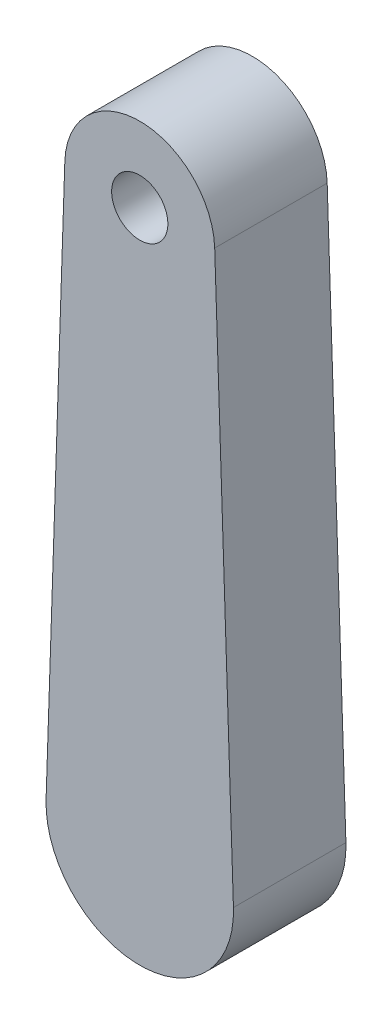
ISO-10303-21;
HEADER;
FILE_DESCRIPTION(('STEP AP214'),'2;1');
FILE_NAME('part.step','',(''),(''),'','','');
FILE_SCHEMA(('AUTOMOTIVE_DESIGN { 1 0 10303 214 1 1 1 1 }'));
ENDSEC;
DATA;
#1=APPLICATION_CONTEXT('core data for automotive mechanical design processes');
#2=APPLICATION_PROTOCOL_DEFINITION('international standard','automotive_design',2000,#1);
#3=PRODUCT_CONTEXT('',#1,'mechanical');
#4=PRODUCT('Part','Part','',(#3));
#5=PRODUCT_RELATED_PRODUCT_CATEGORY('part','',(#4));
#6=PRODUCT_DEFINITION_FORMATION('','',#4);
#7=PRODUCT_DEFINITION_CONTEXT('part definition',#1,'design');
#8=PRODUCT_DEFINITION('design','',#6,#7);
#9=PRODUCT_DEFINITION_SHAPE('','',#8);
#10=(LENGTH_UNIT() NAMED_UNIT(*) SI_UNIT(.MILLI.,.METRE.));
#11=(NAMED_UNIT(*) PLANE_ANGLE_UNIT() SI_UNIT($,.RADIAN.));
#12=(NAMED_UNIT(*) SI_UNIT($,.STERADIAN.) SOLID_ANGLE_UNIT());
#13=UNCERTAINTY_MEASURE_WITH_UNIT(LENGTH_MEASURE(1.E-05),#10,'distance_accuracy_value','');
#14=(GEOMETRIC_REPRESENTATION_CONTEXT(3) GLOBAL_UNCERTAINTY_ASSIGNED_CONTEXT((#13)) GLOBAL_UNIT_ASSIGNED_CONTEXT((#10,
#11,#12)) REPRESENTATION_CONTEXT('',''));
#15=CARTESIAN_POINT('',(0.,0.,0.));
#16=DIRECTION('',(0.,0.,1.));
#17=DIRECTION('',(1.,0.,0.));
#18=AXIS2_PLACEMENT_3D('',#15,#16,#17);
#19=CARTESIAN_POINT('',(0.,0.,-3.));
#20=DIRECTION('',(0.,0.,1.));
#21=DIRECTION('',(1.,0.,0.));
#22=AXIS2_PLACEMENT_3D('',#19,#20,#21);
#23=PLANE('',#22);
#24=CARTESIAN_POINT('',(0.,30.,-3.));
#25=DIRECTION('',(0.,0.,1.));
#26=DIRECTION('',(1.,0.,0.));
#27=AXIS2_PLACEMENT_3D('',#24,#25,#26);
#28=CIRCLE('',#27,1.5);
#29=CARTESIAN_POINT('',(1.5,30.,-3.));
#30=VERTEX_POINT('',#29);
#31=EDGE_CURVE('E119',#30,#30,#28,.T.);
#32=ORIENTED_EDGE('',*,*,#31,.T.);
#33=EDGE_LOOP('',(#32));
#34=FACE_BOUND('',#33,.T.);
#35=CARTESIAN_POINT('',(0.,0.,-3.));
#36=DIRECTION('',(0.,0.,1.));
#37=DIRECTION('',(1.,0.,0.));
#38=AXIS2_PLACEMENT_3D('',#35,#36,#37);
#39=CIRCLE('',#38,5.);
#40=CARTESIAN_POINT('',(-4.99722145018832,0.166666666666667,-3.));
#41=VERTEX_POINT('',#40);
#42=CARTESIAN_POINT('',(4.99722145018832,0.166666666666667,-3.));
#43=VERTEX_POINT('',#42);
#44=EDGE_CURVE('E153',#41,#43,#39,.T.);
#45=ORIENTED_EDGE('',*,*,#44,.F.);
#46=DIRECTION('',(-0.0333333333333333,-0.999444290037663,0.));
#47=VECTOR('',#46,1.);
#48=CARTESIAN_POINT('',(-4.99722145018832,0.166666666666667,-3.));
#49=LINE('',#48,#47);
#50=CARTESIAN_POINT('',(-3.99777716015065,30.1333333333333,-3.));
#51=VERTEX_POINT('',#50);
#52=EDGE_CURVE('E84',#51,#41,#49,.T.);
#53=ORIENTED_EDGE('',*,*,#52,.F.);
#54=CARTESIAN_POINT('',(0.,30.,-3.));
#55=DIRECTION('',(0.,0.,1.));
#56=DIRECTION('',(1.,0.,0.));
#57=AXIS2_PLACEMENT_3D('',#54,#55,#56);
#58=CIRCLE('',#57,4.);
#59=CARTESIAN_POINT('',(3.99777716015065,30.1333333333333,-3.));
#60=VERTEX_POINT('',#59);
#61=EDGE_CURVE('E167',#60,#51,#58,.T.);
#62=ORIENTED_EDGE('',*,*,#61,.F.);
#63=DIRECTION('',(-0.0333333333333334,0.999444290037663,0.));
#64=VECTOR('',#63,1.);
#65=CARTESIAN_POINT('',(4.99722145018832,0.166666666666667,-3.));
#66=LINE('',#65,#64);
#67=EDGE_CURVE('E165',#43,#60,#66,.T.);
#68=ORIENTED_EDGE('',*,*,#67,.F.);
#69=EDGE_LOOP('',(#45,#53,#62,#68));
#70=FACE_BOUND('',#69,.T.);
#71=CARTESIAN_POINT('',(0.,16.,-3.));
#72=DIRECTION('',(0.,0.,1.));
#73=DIRECTION('',(1.,0.,0.));
#74=AXIS2_PLACEMENT_3D('',#71,#72,#73);
#75=CIRCLE('',#74,2.);
#76=CARTESIAN_POINT('',(1.99119154025925,16.1875,-3.));
#77=VERTEX_POINT('',#76);
#78=CARTESIAN_POINT('',(-1.99119154025925,16.1875,-3.));
#79=VERTEX_POINT('',#78);
#80=EDGE_CURVE('E54',#77,#79,#75,.T.);
#81=ORIENTED_EDGE('',*,*,#80,.T.);
#82=DIRECTION('',(-0.09375,-0.995595770129625,0.));
#83=VECTOR('',#82,1.);
#84=CARTESIAN_POINT('',(-1.99119154025925,16.1875,-3.));
#85=LINE('',#84,#83);
#86=CARTESIAN_POINT('',(-3.48458519545368,0.328125,-3.));
#87=VERTEX_POINT('',#86);
#88=EDGE_CURVE('E123',#79,#87,#85,.T.);
#89=ORIENTED_EDGE('',*,*,#88,.T.);
#90=CARTESIAN_POINT('',(0.,0.,-3.));
#91=DIRECTION('',(0.,0.,1.));
#92=DIRECTION('',(1.,0.,0.));
#93=AXIS2_PLACEMENT_3D('',#90,#91,#92);
#94=CIRCLE('',#93,3.5);
#95=CARTESIAN_POINT('',(3.48458519545369,0.328125000000001,-3.));
#96=VERTEX_POINT('',#95);
#97=EDGE_CURVE('E129',#87,#96,#94,.T.);
#98=ORIENTED_EDGE('',*,*,#97,.T.);
#99=DIRECTION('',(-0.09375,0.995595770129625,0.));
#100=VECTOR('',#99,1.);
#101=CARTESIAN_POINT('',(3.48458519545369,0.328125,-3.));
#102=LINE('',#101,#100);
#103=EDGE_CURVE('E133',#96,#77,#102,.T.);
#104=ORIENTED_EDGE('',*,*,#103,.T.);
#105=EDGE_LOOP('',(#81,#89,#98,#104));
#106=FACE_BOUND('',#105,.T.);
#107=ADVANCED_FACE('F39',(#34,#70,#106),#23,.F.);
#108=CARTESIAN_POINT('',(0.,0.,3.));
#109=DIRECTION('',(0.,0.,1.));
#110=DIRECTION('',(1.,0.,0.));
#111=AXIS2_PLACEMENT_3D('',#108,#109,#110);
#112=PLANE('',#111);
#113=CARTESIAN_POINT('',(0.,0.,3.));
#114=DIRECTION('',(0.,0.,1.));
#115=DIRECTION('',(1.,0.,0.));
#116=AXIS2_PLACEMENT_3D('',#113,#114,#115);
#117=CIRCLE('',#116,5.);
#118=CARTESIAN_POINT('',(-4.99722145018832,0.166666666666667,3.));
#119=VERTEX_POINT('',#118);
#120=CARTESIAN_POINT('',(4.99722145018832,0.166666666666667,3.));
#121=VERTEX_POINT('',#120);
#122=EDGE_CURVE('E156',#119,#121,#117,.T.);
#123=ORIENTED_EDGE('',*,*,#122,.T.);
#124=DIRECTION('',(-0.0333333333333334,0.999444290037663,0.));
#125=VECTOR('',#124,1.);
#126=CARTESIAN_POINT('',(4.99722145018832,0.166666666666667,3.));
#127=LINE('',#126,#125);
#128=CARTESIAN_POINT('',(3.99777716015065,30.1333333333333,3.));
#129=VERTEX_POINT('',#128);
#130=EDGE_CURVE('E91',#121,#129,#127,.T.);
#131=ORIENTED_EDGE('',*,*,#130,.T.);
#132=CARTESIAN_POINT('',(0.,30.,3.));
#133=DIRECTION('',(0.,0.,1.));
#134=DIRECTION('',(1.,0.,0.));
#135=AXIS2_PLACEMENT_3D('',#132,#133,#134);
#136=CIRCLE('',#135,4.);
#137=CARTESIAN_POINT('',(-3.99777716015065,30.1333333333333,3.));
#138=VERTEX_POINT('',#137);
#139=EDGE_CURVE('E159',#129,#138,#136,.T.);
#140=ORIENTED_EDGE('',*,*,#139,.T.);
#141=DIRECTION('',(-0.0333333333333333,-0.999444290037663,0.));
#142=VECTOR('',#141,1.);
#143=CARTESIAN_POINT('',(-4.99722145018832,0.166666666666667,3.));
#144=LINE('',#143,#142);
#145=EDGE_CURVE('E63',#138,#119,#144,.T.);
#146=ORIENTED_EDGE('',*,*,#145,.T.);
#147=EDGE_LOOP('',(#123,#131,#140,#146));
#148=FACE_BOUND('',#147,.T.);
#149=CARTESIAN_POINT('',(0.,30.,3.));
#150=DIRECTION('',(0.,0.,1.));
#151=DIRECTION('',(1.,0.,0.));
#152=AXIS2_PLACEMENT_3D('',#149,#150,#151);
#153=CIRCLE('',#152,1.5);
#154=CARTESIAN_POINT('',(1.5,30.,3.));
#155=VERTEX_POINT('',#154);
#156=EDGE_CURVE('E150',#155,#155,#153,.T.);
#157=ORIENTED_EDGE('',*,*,#156,.F.);
#158=EDGE_LOOP('',(#157));
#159=FACE_BOUND('',#158,.T.);
#160=ADVANCED_FACE('F197',(#148,#159),#112,.T.);
#161=CARTESIAN_POINT('',(0.,0.,3.));
#162=DIRECTION('',(0.,0.,-1.));
#163=DIRECTION('',(-1.,0.,0.));
#164=AXIS2_PLACEMENT_3D('',#161,#162,#163);
#165=CYLINDRICAL_SURFACE('',#164,5.);
#166=ORIENTED_EDGE('',*,*,#44,.T.);
#167=DIRECTION('',(0.,0.,-1.));
#168=VECTOR('',#167,1.);
#169=CARTESIAN_POINT('',(4.99722145018832,0.166666666666667,3.));
#170=LINE('',#169,#168);
#171=EDGE_CURVE('E11',#121,#43,#170,.T.);
#172=ORIENTED_EDGE('',*,*,#171,.F.);
#173=ORIENTED_EDGE('',*,*,#122,.F.);
#174=DIRECTION('',(0.,0.,-1.));
#175=VECTOR('',#174,1.);
#176=CARTESIAN_POINT('',(-4.99722145018832,0.166666666666667,3.));
#177=LINE('',#176,#175);
#178=EDGE_CURVE('E162',#119,#41,#177,.T.);
#179=ORIENTED_EDGE('',*,*,#178,.T.);
#180=EDGE_LOOP('',(#166,#172,#173,#179));
#181=FACE_BOUND('',#180,.T.);
#182=ADVANCED_FACE('F41',(#181),#165,.T.);
#183=CARTESIAN_POINT('',(4.99722145018832,0.166666666666667,3.));
#184=DIRECTION('',(-0.999444290037663,-0.0333333333333334,0.));
#185=DIRECTION('',(0.0333333333333334,-0.999444290037663,0.));
#186=AXIS2_PLACEMENT_3D('',#183,#184,#185);
#187=PLANE('',#186);
#188=ORIENTED_EDGE('',*,*,#67,.T.);
#189=DIRECTION('',(0.,0.,-1.));
#190=VECTOR('',#189,1.);
#191=CARTESIAN_POINT('',(3.99777716015065,30.1333333333333,3.));
#192=LINE('',#191,#190);
#193=EDGE_CURVE('E47',#129,#60,#192,.T.);
#194=ORIENTED_EDGE('',*,*,#193,.F.);
#195=ORIENTED_EDGE('',*,*,#130,.F.);
#196=ORIENTED_EDGE('',*,*,#171,.T.);
#197=EDGE_LOOP('',(#188,#194,#195,#196));
#198=FACE_BOUND('',#197,.T.);
#199=ADVANCED_FACE('F193',(#198),#187,.F.);
#200=CARTESIAN_POINT('',(0.,30.,3.));
#201=DIRECTION('',(0.,0.,-1.));
#202=DIRECTION('',(-1.,0.,0.));
#203=AXIS2_PLACEMENT_3D('',#200,#201,#202);
#204=CYLINDRICAL_SURFACE('',#203,4.);
#205=ORIENTED_EDGE('',*,*,#61,.T.);
#206=DIRECTION('',(0.,0.,-1.));
#207=VECTOR('',#206,1.);
#208=CARTESIAN_POINT('',(-3.99777716015065,30.1333333333333,3.));
#209=LINE('',#208,#207);
#210=EDGE_CURVE('E171',#138,#51,#209,.T.);
#211=ORIENTED_EDGE('',*,*,#210,.F.);
#212=ORIENTED_EDGE('',*,*,#139,.F.);
#213=ORIENTED_EDGE('',*,*,#193,.T.);
#214=EDGE_LOOP('',(#205,#211,#212,#213));
#215=FACE_BOUND('',#214,.T.);
#216=ADVANCED_FACE('F176',(#215),#204,.T.);
#217=CARTESIAN_POINT('',(-4.99722145018832,0.166666666666667,3.));
#218=DIRECTION('',(0.999444290037663,-0.0333333333333333,0.));
#219=DIRECTION('',(0.0333333333333333,0.999444290037663,0.));
#220=AXIS2_PLACEMENT_3D('',#217,#218,#219);
#221=PLANE('',#220);
#222=ORIENTED_EDGE('',*,*,#52,.T.);
#223=ORIENTED_EDGE('',*,*,#178,.F.);
#224=ORIENTED_EDGE('',*,*,#145,.F.);
#225=ORIENTED_EDGE('',*,*,#210,.T.);
#226=EDGE_LOOP('',(#222,#223,#224,#225));
#227=FACE_BOUND('',#226,.T.);
#228=ADVANCED_FACE('F183',(#227),#221,.F.);
#229=CARTESIAN_POINT('',(0.,30.,3.));
#230=DIRECTION('',(0.,0.,-1.));
#231=DIRECTION('',(-1.,0.,0.));
#232=AXIS2_PLACEMENT_3D('',#229,#230,#231);
#233=CYLINDRICAL_SURFACE('',#232,1.5);
#234=ORIENTED_EDGE('',*,*,#156,.T.);
#235=EDGE_LOOP('',(#234));
#236=FACE_BOUND('',#235,.T.);
#237=ORIENTED_EDGE('',*,*,#31,.F.);
#238=EDGE_LOOP('',(#237));
#239=FACE_BOUND('',#238,.T.);
#240=ADVANCED_FACE('F185',(#236,#239),#233,.F.);
#241=CARTESIAN_POINT('',(0.,16.,1.));
#242=DIRECTION('',(0.,0.,-1.));
#243=DIRECTION('',(-1.,0.,0.));
#244=AXIS2_PLACEMENT_3D('',#241,#242,#243);
#245=CYLINDRICAL_SURFACE('',#244,2.);
#246=DIRECTION('',(0.,0.,-1.));
#247=VECTOR('',#246,1.);
#248=CARTESIAN_POINT('',(1.99119154025925,16.1875,1.));
#249=LINE('',#248,#247);
#250=CARTESIAN_POINT('',(1.99119154025925,16.1875,1.));
#251=VERTEX_POINT('',#250);
#252=EDGE_CURVE('E145',#251,#77,#249,.T.);
#253=ORIENTED_EDGE('',*,*,#252,.F.);
#254=CARTESIAN_POINT('',(0.,16.,1.));
#255=DIRECTION('',(0.,0.,1.));
#256=DIRECTION('',(1.,0.,0.));
#257=AXIS2_PLACEMENT_3D('',#254,#255,#256);
#258=CIRCLE('',#257,2.);
#259=CARTESIAN_POINT('',(-1.99119154025925,16.1875,1.));
#260=VERTEX_POINT('',#259);
#261=EDGE_CURVE('E117',#251,#260,#258,.T.);
#262=ORIENTED_EDGE('',*,*,#261,.T.);
#263=DIRECTION('',(0.,0.,-1.));
#264=VECTOR('',#263,1.);
#265=CARTESIAN_POINT('',(-1.99119154025925,16.1875,1.));
#266=LINE('',#265,#264);
#267=EDGE_CURVE('E113',#260,#79,#266,.T.);
#268=ORIENTED_EDGE('',*,*,#267,.T.);
#269=ORIENTED_EDGE('',*,*,#80,.F.);
#270=EDGE_LOOP('',(#253,#262,#268,#269));
#271=FACE_BOUND('',#270,.T.);
#272=ADVANCED_FACE('F115',(#271),#245,.F.);
#273=CARTESIAN_POINT('',(-1.99119154025925,16.1875,1.));
#274=DIRECTION('',(0.995595770129625,-0.09375,0.));
#275=DIRECTION('',(0.09375,0.995595770129625,0.));
#276=AXIS2_PLACEMENT_3D('',#273,#274,#275);
#277=PLANE('',#276);
#278=ORIENTED_EDGE('',*,*,#267,.F.);
#279=DIRECTION('',(-0.09375,-0.995595770129625,0.));
#280=VECTOR('',#279,1.);
#281=CARTESIAN_POINT('',(-1.99119154025925,16.1875,1.));
#282=LINE('',#281,#280);
#283=CARTESIAN_POINT('',(-3.48458519545368,0.328125,1.));
#284=VERTEX_POINT('',#283);
#285=EDGE_CURVE('E139',#260,#284,#282,.T.);
#286=ORIENTED_EDGE('',*,*,#285,.T.);
#287=DIRECTION('',(0.,0.,-1.));
#288=VECTOR('',#287,1.);
#289=CARTESIAN_POINT('',(-3.48458519545368,0.328125,1.));
#290=LINE('',#289,#288);
#291=EDGE_CURVE('E120',#284,#87,#290,.T.);
#292=ORIENTED_EDGE('',*,*,#291,.T.);
#293=ORIENTED_EDGE('',*,*,#88,.F.);
#294=EDGE_LOOP('',(#278,#286,#292,#293));
#295=FACE_BOUND('',#294,.T.);
#296=ADVANCED_FACE('F124',(#295),#277,.T.);
#297=CARTESIAN_POINT('',(0.,0.,1.));
#298=DIRECTION('',(0.,0.,-1.));
#299=DIRECTION('',(-1.,0.,0.));
#300=AXIS2_PLACEMENT_3D('',#297,#298,#299);
#301=CYLINDRICAL_SURFACE('',#300,3.5);
#302=ORIENTED_EDGE('',*,*,#291,.F.);
#303=CARTESIAN_POINT('',(0.,0.,1.));
#304=DIRECTION('',(0.,0.,1.));
#305=DIRECTION('',(1.,0.,0.));
#306=AXIS2_PLACEMENT_3D('',#303,#304,#305);
#307=CIRCLE('',#306,3.5);
#308=CARTESIAN_POINT('',(3.48458519545369,0.328125000000001,1.));
#309=VERTEX_POINT('',#308);
#310=EDGE_CURVE('E141',#284,#309,#307,.T.);
#311=ORIENTED_EDGE('',*,*,#310,.T.);
#312=DIRECTION('',(0.,0.,-1.));
#313=VECTOR('',#312,1.);
#314=CARTESIAN_POINT('',(3.48458519545369,0.328125000000001,1.));
#315=LINE('',#314,#313);
#316=EDGE_CURVE('E147',#309,#96,#315,.T.);
#317=ORIENTED_EDGE('',*,*,#316,.T.);
#318=ORIENTED_EDGE('',*,*,#97,.F.);
#319=EDGE_LOOP('',(#302,#311,#317,#318));
#320=FACE_BOUND('',#319,.T.);
#321=ADVANCED_FACE('F208',(#320),#301,.F.);
#322=CARTESIAN_POINT('',(3.48458519545369,0.328125,1.));
#323=DIRECTION('',(-0.995595770129625,-0.09375,0.));
#324=DIRECTION('',(0.09375,-0.995595770129625,0.));
#325=AXIS2_PLACEMENT_3D('',#322,#323,#324);
#326=PLANE('',#325);
#327=ORIENTED_EDGE('',*,*,#316,.F.);
#328=DIRECTION('',(-0.09375,0.995595770129625,0.));
#329=VECTOR('',#328,1.);
#330=CARTESIAN_POINT('',(3.48458519545369,0.328125,1.));
#331=LINE('',#330,#329);
#332=EDGE_CURVE('E143',#309,#251,#331,.T.);
#333=ORIENTED_EDGE('',*,*,#332,.T.);
#334=ORIENTED_EDGE('',*,*,#252,.T.);
#335=ORIENTED_EDGE('',*,*,#103,.F.);
#336=EDGE_LOOP('',(#327,#333,#334,#335));
#337=FACE_BOUND('',#336,.T.);
#338=ADVANCED_FACE('F211',(#337),#326,.T.);
#339=CARTESIAN_POINT('',(0.,16.,1.));
#340=DIRECTION('',(0.,0.,1.));
#341=DIRECTION('',(1.,0.,0.));
#342=AXIS2_PLACEMENT_3D('',#339,#340,#341);
#343=PLANE('',#342);
#344=ORIENTED_EDGE('',*,*,#261,.F.);
#345=ORIENTED_EDGE('',*,*,#332,.F.);
#346=ORIENTED_EDGE('',*,*,#310,.F.);
#347=ORIENTED_EDGE('',*,*,#285,.F.);
#348=EDGE_LOOP('',(#344,#345,#346,#347));
#349=FACE_BOUND('',#348,.T.);
#350=ADVANCED_FACE('F215',(#349),#343,.F.);
#351=CLOSED_SHELL('',(#107,#160,#182,#199,#216,#228,#240,#272,#296,#321,#338,#350));
#352=MANIFOLD_SOLID_BREP('B2',#351);
#353=ADVANCED_BREP_SHAPE_REPRESENTATION('',(#18,#352),#14);
#354=SHAPE_DEFINITION_REPRESENTATION(#9,#353);
ENDSEC;
END-ISO-10303-21;
